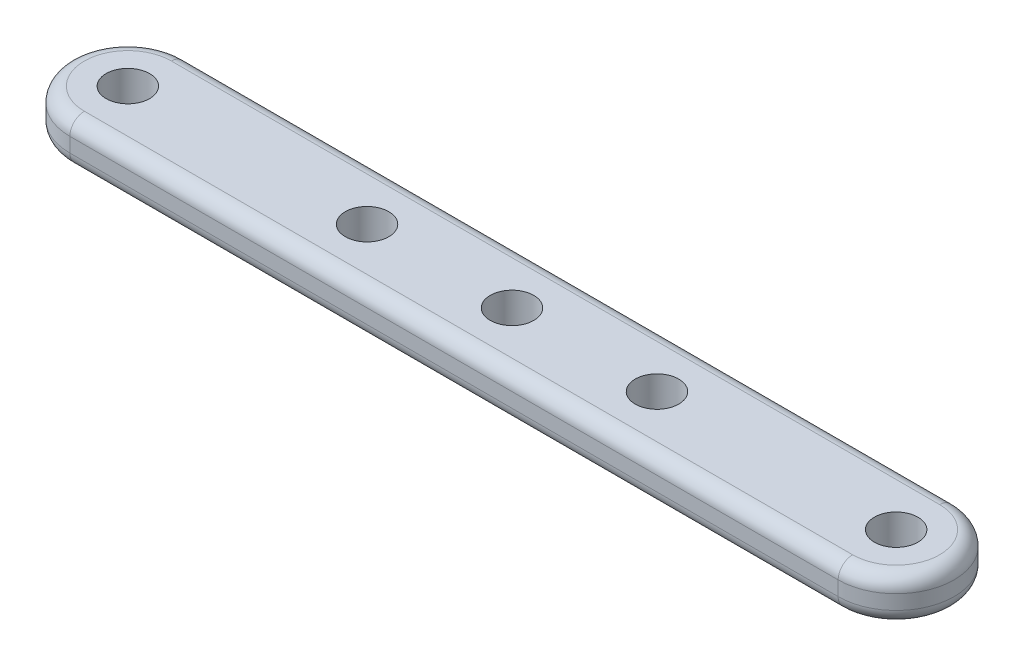
ISO-10303-21;
HEADER;
FILE_DESCRIPTION(('STEP AP214'),'2;1');
FILE_NAME('part.step','',(''),(''),'','','');
FILE_SCHEMA(('AUTOMOTIVE_DESIGN { 1 0 10303 214 1 1 1 1 }'));
ENDSEC;
DATA;
#1=APPLICATION_CONTEXT('core data for automotive mechanical design processes');
#2=APPLICATION_PROTOCOL_DEFINITION('international standard','automotive_design',2000,#1);
#3=PRODUCT_CONTEXT('',#1,'mechanical');
#4=PRODUCT('Part','Part','',(#3));
#5=PRODUCT_RELATED_PRODUCT_CATEGORY('part','',(#4));
#6=PRODUCT_DEFINITION_FORMATION('','',#4);
#7=PRODUCT_DEFINITION_CONTEXT('part definition',#1,'design');
#8=PRODUCT_DEFINITION('design','',#6,#7);
#9=PRODUCT_DEFINITION_SHAPE('','',#8);
#10=(LENGTH_UNIT() NAMED_UNIT(*) SI_UNIT(.MILLI.,.METRE.));
#11=(NAMED_UNIT(*) PLANE_ANGLE_UNIT() SI_UNIT($,.RADIAN.));
#12=(NAMED_UNIT(*) SI_UNIT($,.STERADIAN.) SOLID_ANGLE_UNIT());
#13=UNCERTAINTY_MEASURE_WITH_UNIT(LENGTH_MEASURE(1.E-05),#10,'distance_accuracy_value','');
#14=(GEOMETRIC_REPRESENTATION_CONTEXT(3) GLOBAL_UNCERTAINTY_ASSIGNED_CONTEXT((#13)) GLOBAL_UNIT_ASSIGNED_CONTEXT((#10,
#11,#12)) REPRESENTATION_CONTEXT('',''));
#15=CARTESIAN_POINT('',(0.,0.,0.));
#16=DIRECTION('',(0.,0.,1.));
#17=DIRECTION('',(1.,0.,0.));
#18=AXIS2_PLACEMENT_3D('',#15,#16,#17);
#19=CARTESIAN_POINT('',(0.,3.,-4.));
#20=DIRECTION('',(0.,0.,-1.));
#21=DIRECTION('',(-1.,0.,0.));
#22=AXIS2_PLACEMENT_3D('',#19,#20,#21);
#23=PLANE('',#22);
#24=DIRECTION('',(0.,-1.,0.));
#25=VECTOR('',#24,1.);
#26=CARTESIAN_POINT('',(-26.5,3.,-4.));
#27=LINE('',#26,#25);
#28=CARTESIAN_POINT('',(-26.5,2.,-4.));
#29=VERTEX_POINT('',#28);
#30=CARTESIAN_POINT('',(-26.5,1.,-4.));
#31=VERTEX_POINT('',#30);
#32=EDGE_CURVE('E138',#29,#31,#27,.T.);
#33=ORIENTED_EDGE('',*,*,#32,.F.);
#34=DIRECTION('',(1.,0.,0.));
#35=VECTOR('',#34,1.);
#36=CARTESIAN_POINT('',(0.,2.,-4.));
#37=LINE('',#36,#35);
#38=CARTESIAN_POINT('',(26.5,2.,-4.));
#39=VERTEX_POINT('',#38);
#40=EDGE_CURVE('E11',#29,#39,#37,.T.);
#41=ORIENTED_EDGE('',*,*,#40,.T.);
#42=DIRECTION('',(0.,-1.,0.));
#43=VECTOR('',#42,1.);
#44=CARTESIAN_POINT('',(26.5,3.,-4.));
#45=LINE('',#44,#43);
#46=CARTESIAN_POINT('',(26.5,1.,-4.));
#47=VERTEX_POINT('',#46);
#48=EDGE_CURVE('E247',#39,#47,#45,.T.);
#49=ORIENTED_EDGE('',*,*,#48,.T.);
#50=DIRECTION('',(1.,0.,0.));
#51=VECTOR('',#50,1.);
#52=CARTESIAN_POINT('',(-26.5,1.,-4.));
#53=LINE('',#52,#51);
#54=EDGE_CURVE('E51',#47,#31,#53,.F.);
#55=ORIENTED_EDGE('',*,*,#54,.T.);
#56=EDGE_LOOP('',(#33,#41,#49,#55));
#57=FACE_BOUND('',#56,.T.);
#58=ADVANCED_FACE('F41',(#57),#23,.T.);
#59=CARTESIAN_POINT('',(-26.5,3.,0.));
#60=DIRECTION('',(0.,-1.,0.));
#61=DIRECTION('',(0.,0.,-1.));
#62=AXIS2_PLACEMENT_3D('',#59,#60,#61);
#63=CYLINDRICAL_SURFACE('',#62,4.);
#64=DIRECTION('',(0.,-1.,0.));
#65=VECTOR('',#64,1.);
#66=CARTESIAN_POINT('',(-26.5,3.,4.));
#67=LINE('',#66,#65);
#68=CARTESIAN_POINT('',(-26.5,2.,4.));
#69=VERTEX_POINT('',#68);
#70=CARTESIAN_POINT('',(-26.5,1.,4.));
#71=VERTEX_POINT('',#70);
#72=EDGE_CURVE('E142',#69,#71,#67,.T.);
#73=ORIENTED_EDGE('',*,*,#72,.F.);
#74=CARTESIAN_POINT('',(-26.5,2.,0.));
#75=DIRECTION('',(0.,1.,0.));
#76=DIRECTION('',(0.,0.,1.));
#77=AXIS2_PLACEMENT_3D('',#74,#75,#76);
#78=CIRCLE('',#77,4.);
#79=EDGE_CURVE('E154',#69,#29,#78,.F.);
#80=ORIENTED_EDGE('',*,*,#79,.T.);
#81=ORIENTED_EDGE('',*,*,#32,.T.);
#82=CARTESIAN_POINT('',(-26.5,1.,0.));
#83=DIRECTION('',(0.,1.,0.));
#84=DIRECTION('',(0.,0.,1.));
#85=AXIS2_PLACEMENT_3D('',#82,#83,#84);
#86=CIRCLE('',#85,4.);
#87=EDGE_CURVE('E150',#31,#71,#86,.T.);
#88=ORIENTED_EDGE('',*,*,#87,.T.);
#89=EDGE_LOOP('',(#73,#80,#81,#88));
#90=FACE_BOUND('',#89,.T.);
#91=ADVANCED_FACE('F264',(#90),#63,.T.);
#92=CARTESIAN_POINT('',(0.,3.,4.));
#93=DIRECTION('',(0.,0.,-1.));
#94=DIRECTION('',(-1.,0.,0.));
#95=AXIS2_PLACEMENT_3D('',#92,#93,#94);
#96=PLANE('',#95);
#97=DIRECTION('',(0.,-1.,0.));
#98=VECTOR('',#97,1.);
#99=CARTESIAN_POINT('',(26.5,3.,4.));
#100=LINE('',#99,#98);
#101=CARTESIAN_POINT('',(26.5,2.,4.));
#102=VERTEX_POINT('',#101);
#103=CARTESIAN_POINT('',(26.5,1.,4.));
#104=VERTEX_POINT('',#103);
#105=EDGE_CURVE('E251',#102,#104,#100,.T.);
#106=ORIENTED_EDGE('',*,*,#105,.F.);
#107=DIRECTION('',(1.,0.,0.));
#108=VECTOR('',#107,1.);
#109=CARTESIAN_POINT('',(-26.5,2.,4.));
#110=LINE('',#109,#108);
#111=EDGE_CURVE('E176',#102,#69,#110,.F.);
#112=ORIENTED_EDGE('',*,*,#111,.T.);
#113=ORIENTED_EDGE('',*,*,#72,.T.);
#114=DIRECTION('',(1.,0.,0.));
#115=VECTOR('',#114,1.);
#116=CARTESIAN_POINT('',(0.,1.,4.));
#117=LINE('',#116,#115);
#118=EDGE_CURVE('E173',#71,#104,#117,.T.);
#119=ORIENTED_EDGE('',*,*,#118,.T.);
#120=EDGE_LOOP('',(#106,#112,#113,#119));
#121=FACE_BOUND('',#120,.T.);
#122=ADVANCED_FACE('F260',(#121),#96,.F.);
#123=CARTESIAN_POINT('',(9.99999999999999,3.,0.));
#124=DIRECTION('',(0.,-1.,0.));
#125=DIRECTION('',(0.,0.,-1.));
#126=AXIS2_PLACEMENT_3D('',#123,#124,#125);
#127=CYLINDRICAL_SURFACE('',#126,1.5);
#128=CARTESIAN_POINT('',(9.99999999999999,3.,0.));
#129=DIRECTION('',(0.,1.,0.));
#130=DIRECTION('',(0.,0.,1.));
#131=AXIS2_PLACEMENT_3D('',#128,#129,#130);
#132=CIRCLE('',#131,1.5);
#133=CARTESIAN_POINT('',(9.99999999999999,3.,1.5));
#134=VERTEX_POINT('',#133);
#135=EDGE_CURVE('E317',#134,#134,#132,.T.);
#136=ORIENTED_EDGE('',*,*,#135,.T.);
#137=EDGE_LOOP('',(#136));
#138=FACE_BOUND('',#137,.T.);
#139=CARTESIAN_POINT('',(9.99999999999999,0.,0.));
#140=DIRECTION('',(0.,1.,0.));
#141=DIRECTION('',(0.,0.,1.));
#142=AXIS2_PLACEMENT_3D('',#139,#140,#141);
#143=CIRCLE('',#142,1.5);
#144=CARTESIAN_POINT('',(9.99999999999999,0.,1.5));
#145=VERTEX_POINT('',#144);
#146=EDGE_CURVE('E231',#145,#145,#143,.T.);
#147=ORIENTED_EDGE('',*,*,#146,.F.);
#148=EDGE_LOOP('',(#147));
#149=FACE_BOUND('',#148,.T.);
#150=ADVANCED_FACE('F339',(#138,#149),#127,.F.);
#151=CARTESIAN_POINT('',(26.5,3.,0.));
#152=DIRECTION('',(0.,-1.,0.));
#153=DIRECTION('',(0.,0.,-1.));
#154=AXIS2_PLACEMENT_3D('',#151,#152,#153);
#155=CYLINDRICAL_SURFACE('',#154,4.);
#156=ORIENTED_EDGE('',*,*,#48,.F.);
#157=CARTESIAN_POINT('',(26.5,2.,0.));
#158=DIRECTION('',(0.,1.,0.));
#159=DIRECTION('',(0.,0.,1.));
#160=AXIS2_PLACEMENT_3D('',#157,#158,#159);
#161=CIRCLE('',#160,4.);
#162=EDGE_CURVE('E127',#39,#102,#161,.F.);
#163=ORIENTED_EDGE('',*,*,#162,.T.);
#164=ORIENTED_EDGE('',*,*,#105,.T.);
#165=CARTESIAN_POINT('',(26.5,1.,0.));
#166=DIRECTION('',(0.,1.,0.));
#167=DIRECTION('',(0.,0.,1.));
#168=AXIS2_PLACEMENT_3D('',#165,#166,#167);
#169=CIRCLE('',#168,4.);
#170=EDGE_CURVE('E158',#104,#47,#169,.T.);
#171=ORIENTED_EDGE('',*,*,#170,.T.);
#172=EDGE_LOOP('',(#156,#163,#164,#171));
#173=FACE_BOUND('',#172,.T.);
#174=ADVANCED_FACE('F292',(#173),#155,.T.);
#175=CARTESIAN_POINT('',(-26.5,3.,0.));
#176=DIRECTION('',(0.,-1.,0.));
#177=DIRECTION('',(0.,0.,-1.));
#178=AXIS2_PLACEMENT_3D('',#175,#176,#177);
#179=CYLINDRICAL_SURFACE('',#178,1.5);
#180=CARTESIAN_POINT('',(-26.5,3.,0.));
#181=DIRECTION('',(0.,1.,0.));
#182=DIRECTION('',(0.,0.,1.));
#183=AXIS2_PLACEMENT_3D('',#180,#181,#182);
#184=CIRCLE('',#183,1.5);
#185=CARTESIAN_POINT('',(-26.5,3.,1.5));
#186=VERTEX_POINT('',#185);
#187=EDGE_CURVE('E321',#186,#186,#184,.T.);
#188=ORIENTED_EDGE('',*,*,#187,.T.);
#189=EDGE_LOOP('',(#188));
#190=FACE_BOUND('',#189,.T.);
#191=CARTESIAN_POINT('',(-26.5,0.,0.));
#192=DIRECTION('',(0.,1.,0.));
#193=DIRECTION('',(0.,0.,1.));
#194=AXIS2_PLACEMENT_3D('',#191,#192,#193);
#195=CIRCLE('',#194,1.5);
#196=CARTESIAN_POINT('',(-26.5,0.,1.5));
#197=VERTEX_POINT('',#196);
#198=EDGE_CURVE('E227',#197,#197,#195,.T.);
#199=ORIENTED_EDGE('',*,*,#198,.F.);
#200=EDGE_LOOP('',(#199));
#201=FACE_BOUND('',#200,.T.);
#202=ADVANCED_FACE('F288',(#190,#201),#179,.F.);
#203=CARTESIAN_POINT('',(-10.,3.,0.));
#204=DIRECTION('',(0.,-1.,0.));
#205=DIRECTION('',(0.,0.,-1.));
#206=AXIS2_PLACEMENT_3D('',#203,#204,#205);
#207=CYLINDRICAL_SURFACE('',#206,1.5);
#208=CARTESIAN_POINT('',(-10.,3.,0.));
#209=DIRECTION('',(0.,1.,0.));
#210=DIRECTION('',(0.,0.,1.));
#211=AXIS2_PLACEMENT_3D('',#208,#209,#210);
#212=CIRCLE('',#211,1.5);
#213=CARTESIAN_POINT('',(-10.,3.,1.5));
#214=VERTEX_POINT('',#213);
#215=EDGE_CURVE('E242',#214,#214,#212,.T.);
#216=ORIENTED_EDGE('',*,*,#215,.T.);
#217=EDGE_LOOP('',(#216));
#218=FACE_BOUND('',#217,.T.);
#219=CARTESIAN_POINT('',(-10.,0.,0.));
#220=DIRECTION('',(0.,1.,0.));
#221=DIRECTION('',(0.,0.,1.));
#222=AXIS2_PLACEMENT_3D('',#219,#220,#221);
#223=CIRCLE('',#222,1.5);
#224=CARTESIAN_POINT('',(-10.,0.,1.5));
#225=VERTEX_POINT('',#224);
#226=EDGE_CURVE('E223',#225,#225,#223,.T.);
#227=ORIENTED_EDGE('',*,*,#226,.F.);
#228=EDGE_LOOP('',(#227));
#229=FACE_BOUND('',#228,.T.);
#230=ADVANCED_FACE('F291',(#218,#229),#207,.F.);
#231=CARTESIAN_POINT('',(0.,3.,0.));
#232=DIRECTION('',(0.,-1.,0.));
#233=DIRECTION('',(0.,0.,-1.));
#234=AXIS2_PLACEMENT_3D('',#231,#232,#233);
#235=CYLINDRICAL_SURFACE('',#234,1.5);
#236=CARTESIAN_POINT('',(0.,3.,0.));
#237=DIRECTION('',(0.,1.,0.));
#238=DIRECTION('',(0.,0.,1.));
#239=AXIS2_PLACEMENT_3D('',#236,#237,#238);
#240=CIRCLE('',#239,1.5);
#241=CARTESIAN_POINT('',(0.,3.,1.5));
#242=VERTEX_POINT('',#241);
#243=EDGE_CURVE('E237',#242,#242,#240,.T.);
#244=ORIENTED_EDGE('',*,*,#243,.T.);
#245=EDGE_LOOP('',(#244));
#246=FACE_BOUND('',#245,.T.);
#247=CARTESIAN_POINT('',(0.,0.,0.));
#248=DIRECTION('',(0.,1.,0.));
#249=DIRECTION('',(0.,0.,1.));
#250=AXIS2_PLACEMENT_3D('',#247,#248,#249);
#251=CIRCLE('',#250,1.5);
#252=CARTESIAN_POINT('',(0.,0.,1.5));
#253=VERTEX_POINT('',#252);
#254=EDGE_CURVE('E131',#253,#253,#251,.T.);
#255=ORIENTED_EDGE('',*,*,#254,.F.);
#256=EDGE_LOOP('',(#255));
#257=FACE_BOUND('',#256,.T.);
#258=ADVANCED_FACE('F296',(#246,#257),#235,.F.);
#259=CARTESIAN_POINT('',(26.5,3.,0.));
#260=DIRECTION('',(0.,-1.,0.));
#261=DIRECTION('',(0.,0.,-1.));
#262=AXIS2_PLACEMENT_3D('',#259,#260,#261);
#263=CYLINDRICAL_SURFACE('',#262,1.49999999999999);
#264=CARTESIAN_POINT('',(26.5,3.,0.));
#265=DIRECTION('',(0.,1.,0.));
#266=DIRECTION('',(0.,0.,1.));
#267=AXIS2_PLACEMENT_3D('',#264,#265,#266);
#268=CIRCLE('',#267,1.49999999999999);
#269=CARTESIAN_POINT('',(26.5,3.,1.49999999999999));
#270=VERTEX_POINT('',#269);
#271=EDGE_CURVE('E252',#270,#270,#268,.T.);
#272=ORIENTED_EDGE('',*,*,#271,.T.);
#273=EDGE_LOOP('',(#272));
#274=FACE_BOUND('',#273,.T.);
#275=CARTESIAN_POINT('',(26.5,0.,0.));
#276=DIRECTION('',(0.,1.,0.));
#277=DIRECTION('',(0.,0.,1.));
#278=AXIS2_PLACEMENT_3D('',#275,#276,#277);
#279=CIRCLE('',#278,1.49999999999999);
#280=CARTESIAN_POINT('',(26.5,0.,1.49999999999999));
#281=VERTEX_POINT('',#280);
#282=EDGE_CURVE('E234',#281,#281,#279,.T.);
#283=ORIENTED_EDGE('',*,*,#282,.F.);
#284=EDGE_LOOP('',(#283));
#285=FACE_BOUND('',#284,.T.);
#286=ADVANCED_FACE('F299',(#274,#285),#263,.F.);
#287=CARTESIAN_POINT('',(0.,3.,0.));
#288=DIRECTION('',(0.,1.,0.));
#289=DIRECTION('',(0.,0.,1.));
#290=AXIS2_PLACEMENT_3D('',#287,#288,#289);
#291=PLANE('',#290);
#292=CARTESIAN_POINT('',(-26.5,3.,0.));
#293=DIRECTION('',(0.,1.,0.));
#294=DIRECTION('',(0.,0.,1.));
#295=AXIS2_PLACEMENT_3D('',#292,#293,#294);
#296=CIRCLE('',#295,3.);
#297=CARTESIAN_POINT('',(-26.5,3.,-3.));
#298=VERTEX_POINT('',#297);
#299=CARTESIAN_POINT('',(-26.5,3.,3.));
#300=VERTEX_POINT('',#299);
#301=EDGE_CURVE('E121',#298,#300,#296,.T.);
#302=ORIENTED_EDGE('',*,*,#301,.T.);
#303=DIRECTION('',(1.,0.,0.));
#304=VECTOR('',#303,1.);
#305=CARTESIAN_POINT('',(26.5,3.,3.));
#306=LINE('',#305,#304);
#307=CARTESIAN_POINT('',(26.5,3.,3.));
#308=VERTEX_POINT('',#307);
#309=EDGE_CURVE('E116',#300,#308,#306,.T.);
#310=ORIENTED_EDGE('',*,*,#309,.T.);
#311=CARTESIAN_POINT('',(26.5,3.,0.));
#312=DIRECTION('',(0.,1.,0.));
#313=DIRECTION('',(0.,0.,1.));
#314=AXIS2_PLACEMENT_3D('',#311,#312,#313);
#315=CIRCLE('',#314,3.);
#316=CARTESIAN_POINT('',(26.5,3.,-3.));
#317=VERTEX_POINT('',#316);
#318=EDGE_CURVE('E107',#308,#317,#315,.T.);
#319=ORIENTED_EDGE('',*,*,#318,.T.);
#320=DIRECTION('',(1.,0.,0.));
#321=VECTOR('',#320,1.);
#322=CARTESIAN_POINT('',(0.,3.,-3.));
#323=LINE('',#322,#321);
#324=EDGE_CURVE('E113',#317,#298,#323,.F.);
#325=ORIENTED_EDGE('',*,*,#324,.T.);
#326=EDGE_LOOP('',(#302,#310,#319,#325));
#327=FACE_BOUND('',#326,.T.);
#328=ORIENTED_EDGE('',*,*,#243,.F.);
#329=EDGE_LOOP('',(#328));
#330=FACE_BOUND('',#329,.T.);
#331=ORIENTED_EDGE('',*,*,#215,.F.);
#332=EDGE_LOOP('',(#331));
#333=FACE_BOUND('',#332,.T.);
#334=ORIENTED_EDGE('',*,*,#187,.F.);
#335=EDGE_LOOP('',(#334));
#336=FACE_BOUND('',#335,.T.);
#337=ORIENTED_EDGE('',*,*,#135,.F.);
#338=EDGE_LOOP('',(#337));
#339=FACE_BOUND('',#338,.T.);
#340=ORIENTED_EDGE('',*,*,#271,.F.);
#341=EDGE_LOOP('',(#340));
#342=FACE_BOUND('',#341,.T.);
#343=ADVANCED_FACE('F110',(#327,#330,#333,#336,#339,#342),#291,.T.);
#344=CARTESIAN_POINT('',(0.,0.,0.));
#345=DIRECTION('',(0.,1.,0.));
#346=DIRECTION('',(0.,0.,1.));
#347=AXIS2_PLACEMENT_3D('',#344,#345,#346);
#348=PLANE('',#347);
#349=CARTESIAN_POINT('',(26.5,0.,0.));
#350=DIRECTION('',(0.,1.,0.));
#351=DIRECTION('',(0.,0.,1.));
#352=AXIS2_PLACEMENT_3D('',#349,#350,#351);
#353=CIRCLE('',#352,3.);
#354=CARTESIAN_POINT('',(26.5,0.,-3.));
#355=VERTEX_POINT('',#354);
#356=CARTESIAN_POINT('',(26.5,0.,3.));
#357=VERTEX_POINT('',#356);
#358=EDGE_CURVE('E64',#355,#357,#353,.F.);
#359=ORIENTED_EDGE('',*,*,#358,.T.);
#360=DIRECTION('',(1.,0.,0.));
#361=VECTOR('',#360,1.);
#362=CARTESIAN_POINT('',(0.,0.,3.));
#363=LINE('',#362,#361);
#364=CARTESIAN_POINT('',(-26.5,0.,3.));
#365=VERTEX_POINT('',#364);
#366=EDGE_CURVE('E59',#357,#365,#363,.F.);
#367=ORIENTED_EDGE('',*,*,#366,.T.);
#368=CARTESIAN_POINT('',(-26.5,0.,0.));
#369=DIRECTION('',(0.,1.,0.));
#370=DIRECTION('',(0.,0.,1.));
#371=AXIS2_PLACEMENT_3D('',#368,#369,#370);
#372=CIRCLE('',#371,3.);
#373=CARTESIAN_POINT('',(-26.5,0.,-3.));
#374=VERTEX_POINT('',#373);
#375=EDGE_CURVE('E168',#365,#374,#372,.F.);
#376=ORIENTED_EDGE('',*,*,#375,.T.);
#377=DIRECTION('',(1.,0.,0.));
#378=VECTOR('',#377,1.);
#379=CARTESIAN_POINT('',(26.5,0.,-3.));
#380=LINE('',#379,#378);
#381=EDGE_CURVE('E163',#374,#355,#380,.T.);
#382=ORIENTED_EDGE('',*,*,#381,.T.);
#383=EDGE_LOOP('',(#359,#367,#376,#382));
#384=FACE_BOUND('',#383,.T.);
#385=ORIENTED_EDGE('',*,*,#254,.T.);
#386=EDGE_LOOP('',(#385));
#387=FACE_BOUND('',#386,.T.);
#388=ORIENTED_EDGE('',*,*,#226,.T.);
#389=EDGE_LOOP('',(#388));
#390=FACE_BOUND('',#389,.T.);
#391=ORIENTED_EDGE('',*,*,#198,.T.);
#392=EDGE_LOOP('',(#391));
#393=FACE_BOUND('',#392,.T.);
#394=ORIENTED_EDGE('',*,*,#146,.T.);
#395=EDGE_LOOP('',(#394));
#396=FACE_BOUND('',#395,.T.);
#397=ORIENTED_EDGE('',*,*,#282,.T.);
#398=EDGE_LOOP('',(#397));
#399=FACE_BOUND('',#398,.T.);
#400=ADVANCED_FACE('F213',(#384,#387,#390,#393,#396,#399),#348,.F.);
#401=CARTESIAN_POINT('',(26.5,2.,0.));
#402=DIRECTION('',(0.,1.,0.));
#403=DIRECTION('',(0.,0.,1.));
#404=AXIS2_PLACEMENT_3D('',#401,#402,#403);
#405=TOROIDAL_SURFACE('',#404,3.,1.);
#406=CARTESIAN_POINT('',(26.5,2.,3.));
#407=DIRECTION('',(-1.,0.,0.));
#408=DIRECTION('',(0.,0.,1.));
#409=AXIS2_PLACEMENT_3D('',#406,#407,#408);
#410=CIRCLE('',#409,1.);
#411=EDGE_CURVE('E132',#102,#308,#410,.T.);
#412=ORIENTED_EDGE('',*,*,#411,.F.);
#413=ORIENTED_EDGE('',*,*,#162,.F.);
#414=CARTESIAN_POINT('',(26.5,2.,-3.));
#415=DIRECTION('',(-1.,0.,0.));
#416=DIRECTION('',(0.,0.,1.));
#417=AXIS2_PLACEMENT_3D('',#414,#415,#416);
#418=CIRCLE('',#417,1.);
#419=EDGE_CURVE('E125',#317,#39,#418,.T.);
#420=ORIENTED_EDGE('',*,*,#419,.F.);
#421=ORIENTED_EDGE('',*,*,#318,.F.);
#422=EDGE_LOOP('',(#412,#413,#420,#421));
#423=FACE_BOUND('',#422,.T.);
#424=ADVANCED_FACE('F126',(#423),#405,.T.);
#425=CARTESIAN_POINT('',(0.,2.,-3.));
#426=DIRECTION('',(1.,0.,0.));
#427=DIRECTION('',(0.,0.,-1.));
#428=AXIS2_PLACEMENT_3D('',#425,#426,#427);
#429=CYLINDRICAL_SURFACE('',#428,1.);
#430=ORIENTED_EDGE('',*,*,#419,.T.);
#431=ORIENTED_EDGE('',*,*,#40,.F.);
#432=CARTESIAN_POINT('',(-26.5,2.,-3.));
#433=DIRECTION('',(-1.,0.,0.));
#434=DIRECTION('',(0.,0.,1.));
#435=AXIS2_PLACEMENT_3D('',#432,#433,#434);
#436=CIRCLE('',#435,1.);
#437=EDGE_CURVE('E135',#298,#29,#436,.T.);
#438=ORIENTED_EDGE('',*,*,#437,.F.);
#439=ORIENTED_EDGE('',*,*,#324,.F.);
#440=EDGE_LOOP('',(#430,#431,#438,#439));
#441=FACE_BOUND('',#440,.T.);
#442=ADVANCED_FACE('F134',(#441),#429,.T.);
#443=CARTESIAN_POINT('',(0.,2.,3.));
#444=DIRECTION('',(-1.,0.,0.));
#445=DIRECTION('',(0.,0.,1.));
#446=AXIS2_PLACEMENT_3D('',#443,#444,#445);
#447=CYLINDRICAL_SURFACE('',#446,1.);
#448=ORIENTED_EDGE('',*,*,#411,.T.);
#449=ORIENTED_EDGE('',*,*,#309,.F.);
#450=CARTESIAN_POINT('',(-26.5,2.,3.));
#451=DIRECTION('',(-1.,0.,0.));
#452=DIRECTION('',(0.,0.,1.));
#453=AXIS2_PLACEMENT_3D('',#450,#451,#452);
#454=CIRCLE('',#453,1.);
#455=EDGE_CURVE('E181',#69,#300,#454,.T.);
#456=ORIENTED_EDGE('',*,*,#455,.F.);
#457=ORIENTED_EDGE('',*,*,#111,.F.);
#458=EDGE_LOOP('',(#448,#449,#456,#457));
#459=FACE_BOUND('',#458,.T.);
#460=ADVANCED_FACE('F270',(#459),#447,.T.);
#461=CARTESIAN_POINT('',(-26.5,2.,0.));
#462=DIRECTION('',(0.,1.,0.));
#463=DIRECTION('',(0.,0.,1.));
#464=AXIS2_PLACEMENT_3D('',#461,#462,#463);
#465=TOROIDAL_SURFACE('',#464,3.,1.);
#466=ORIENTED_EDGE('',*,*,#437,.T.);
#467=ORIENTED_EDGE('',*,*,#79,.F.);
#468=ORIENTED_EDGE('',*,*,#455,.T.);
#469=ORIENTED_EDGE('',*,*,#301,.F.);
#470=EDGE_LOOP('',(#466,#467,#468,#469));
#471=FACE_BOUND('',#470,.T.);
#472=ADVANCED_FACE('F268',(#471),#465,.T.);
#473=CARTESIAN_POINT('',(26.5,1.,0.));
#474=DIRECTION('',(0.,1.,0.));
#475=DIRECTION('',(0.,0.,1.));
#476=AXIS2_PLACEMENT_3D('',#473,#474,#475);
#477=TOROIDAL_SURFACE('',#476,3.,1.);
#478=CARTESIAN_POINT('',(26.5,1.,3.));
#479=DIRECTION('',(-1.,0.,0.));
#480=DIRECTION('',(0.,0.,1.));
#481=AXIS2_PLACEMENT_3D('',#478,#479,#480);
#482=CIRCLE('',#481,1.);
#483=EDGE_CURVE('E193',#357,#104,#482,.T.);
#484=ORIENTED_EDGE('',*,*,#483,.F.);
#485=ORIENTED_EDGE('',*,*,#358,.F.);
#486=CARTESIAN_POINT('',(26.5,1.,-3.));
#487=DIRECTION('',(-1.,0.,0.));
#488=DIRECTION('',(0.,0.,1.));
#489=AXIS2_PLACEMENT_3D('',#486,#487,#488);
#490=CIRCLE('',#489,1.);
#491=EDGE_CURVE('E45',#47,#355,#490,.T.);
#492=ORIENTED_EDGE('',*,*,#491,.F.);
#493=ORIENTED_EDGE('',*,*,#170,.F.);
#494=EDGE_LOOP('',(#484,#485,#492,#493));
#495=FACE_BOUND('',#494,.T.);
#496=ADVANCED_FACE('F43',(#495),#477,.T.);
#497=CARTESIAN_POINT('',(0.,1.,-3.));
#498=DIRECTION('',(-1.,0.,0.));
#499=DIRECTION('',(0.,0.,1.));
#500=AXIS2_PLACEMENT_3D('',#497,#498,#499);
#501=CYLINDRICAL_SURFACE('',#500,1.);
#502=ORIENTED_EDGE('',*,*,#491,.T.);
#503=ORIENTED_EDGE('',*,*,#381,.F.);
#504=CARTESIAN_POINT('',(-26.5,1.,-3.));
#505=DIRECTION('',(-1.,0.,0.));
#506=DIRECTION('',(0.,0.,1.));
#507=AXIS2_PLACEMENT_3D('',#504,#505,#506);
#508=CIRCLE('',#507,1.);
#509=EDGE_CURVE('E191',#31,#374,#508,.T.);
#510=ORIENTED_EDGE('',*,*,#509,.F.);
#511=ORIENTED_EDGE('',*,*,#54,.F.);
#512=EDGE_LOOP('',(#502,#503,#510,#511));
#513=FACE_BOUND('',#512,.T.);
#514=ADVANCED_FACE('F204',(#513),#501,.T.);
#515=CARTESIAN_POINT('',(0.,1.,3.));
#516=DIRECTION('',(1.,0.,0.));
#517=DIRECTION('',(0.,0.,-1.));
#518=AXIS2_PLACEMENT_3D('',#515,#516,#517);
#519=CYLINDRICAL_SURFACE('',#518,1.);
#520=ORIENTED_EDGE('',*,*,#483,.T.);
#521=ORIENTED_EDGE('',*,*,#118,.F.);
#522=CARTESIAN_POINT('',(-26.5,1.,3.));
#523=DIRECTION('',(-1.,0.,0.));
#524=DIRECTION('',(0.,0.,1.));
#525=AXIS2_PLACEMENT_3D('',#522,#523,#524);
#526=CIRCLE('',#525,1.);
#527=EDGE_CURVE('E188',#365,#71,#526,.T.);
#528=ORIENTED_EDGE('',*,*,#527,.F.);
#529=ORIENTED_EDGE('',*,*,#366,.F.);
#530=EDGE_LOOP('',(#520,#521,#528,#529));
#531=FACE_BOUND('',#530,.T.);
#532=ADVANCED_FACE('F209',(#531),#519,.T.);
#533=CARTESIAN_POINT('',(-26.5,1.,0.));
#534=DIRECTION('',(0.,1.,0.));
#535=DIRECTION('',(0.,0.,1.));
#536=AXIS2_PLACEMENT_3D('',#533,#534,#535);
#537=TOROIDAL_SURFACE('',#536,3.,1.);
#538=ORIENTED_EDGE('',*,*,#509,.T.);
#539=ORIENTED_EDGE('',*,*,#375,.F.);
#540=ORIENTED_EDGE('',*,*,#527,.T.);
#541=ORIENTED_EDGE('',*,*,#87,.F.);
#542=EDGE_LOOP('',(#538,#539,#540,#541));
#543=FACE_BOUND('',#542,.T.);
#544=ADVANCED_FACE('F212',(#543),#537,.T.);
#545=CLOSED_SHELL('',(#58,#91,#122,#150,#174,#202,#230,#258,#286,#343,#400,#424,#442,#460,#472,
#496,#514,#532,#544));
#546=MANIFOLD_SOLID_BREP('B2',#545);
#547=ADVANCED_BREP_SHAPE_REPRESENTATION('',(#18,#546),#14);
#548=SHAPE_DEFINITION_REPRESENTATION(#9,#547);
ENDSEC;
END-ISO-10303-21;
